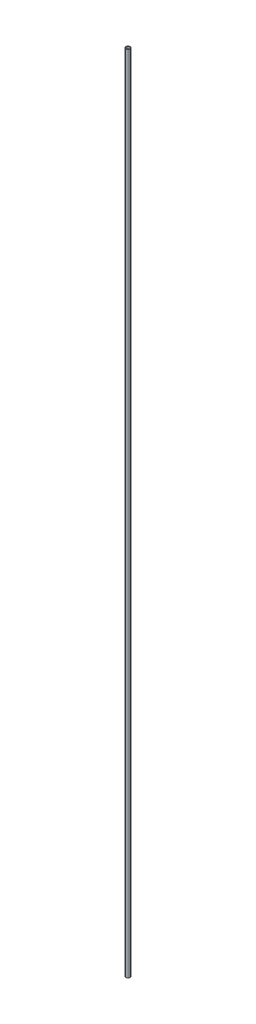
ISO-10303-21;
HEADER;
FILE_DESCRIPTION(('STEP AP214'),'2;1');
FILE_NAME('part.step','',(''),(''),'','','');
FILE_SCHEMA(('AUTOMOTIVE_DESIGN { 1 0 10303 214 1 1 1 1 }'));
ENDSEC;
DATA;
#1=APPLICATION_CONTEXT('core data for automotive mechanical design processes');
#2=APPLICATION_PROTOCOL_DEFINITION('international standard','automotive_design',2000,#1);
#3=PRODUCT_CONTEXT('',#1,'mechanical');
#4=PRODUCT('Part','Part','',(#3));
#5=PRODUCT_RELATED_PRODUCT_CATEGORY('part','',(#4));
#6=PRODUCT_DEFINITION_FORMATION('','',#4);
#7=PRODUCT_DEFINITION_CONTEXT('part definition',#1,'design');
#8=PRODUCT_DEFINITION('design','',#6,#7);
#9=PRODUCT_DEFINITION_SHAPE('','',#8);
#10=(LENGTH_UNIT() NAMED_UNIT(*) SI_UNIT(.MILLI.,.METRE.));
#11=(NAMED_UNIT(*) PLANE_ANGLE_UNIT() SI_UNIT($,.RADIAN.));
#12=(NAMED_UNIT(*) SI_UNIT($,.STERADIAN.) SOLID_ANGLE_UNIT());
#13=UNCERTAINTY_MEASURE_WITH_UNIT(LENGTH_MEASURE(1.E-05),#10,'distance_accuracy_value','');
#14=(GEOMETRIC_REPRESENTATION_CONTEXT(3) GLOBAL_UNCERTAINTY_ASSIGNED_CONTEXT((#13)) GLOBAL_UNIT_ASSIGNED_CONTEXT((#10,
#11,#12)) REPRESENTATION_CONTEXT('',''));
#15=CARTESIAN_POINT('',(0.,0.,0.));
#16=DIRECTION('',(0.,0.,1.));
#17=DIRECTION('',(1.,0.,0.));
#18=AXIS2_PLACEMENT_3D('',#15,#16,#17);
#19=CARTESIAN_POINT('',(0.,1397.,0.));
#20=DIRECTION('',(0.,1.,0.));
#21=DIRECTION('',(0.,0.,1.));
#22=AXIS2_PLACEMENT_3D('',#19,#20,#21);
#23=PLANE('',#22);
#24=CARTESIAN_POINT('',(0.,1397.,0.));
#25=DIRECTION('',(0.,1.,0.));
#26=DIRECTION('',(0.,0.,1.));
#27=AXIS2_PLACEMENT_3D('',#24,#25,#26);
#28=CIRCLE('',#27,3.6195);
#29=CARTESIAN_POINT('',(0.,1397.,3.6195));
#30=VERTEX_POINT('',#29);
#31=EDGE_CURVE('E10',#30,#30,#28,.T.);
#32=ORIENTED_EDGE('',*,*,#31,.T.);
#33=EDGE_LOOP('',(#32));
#34=FACE_BOUND('',#33,.T.);
#35=CARTESIAN_POINT('',(0.,1397.,0.));
#36=DIRECTION('',(0.,1.,0.));
#37=DIRECTION('',(0.,0.,1.));
#38=AXIS2_PLACEMENT_3D('',#35,#36,#37);
#39=CIRCLE('',#38,2.8575);
#40=CARTESIAN_POINT('',(0.,1397.,2.8575));
#41=VERTEX_POINT('',#40);
#42=EDGE_CURVE('E50',#41,#41,#39,.T.);
#43=ORIENTED_EDGE('',*,*,#42,.F.);
#44=EDGE_LOOP('',(#43));
#45=FACE_BOUND('',#44,.T.);
#46=ADVANCED_FACE('F37',(#34,#45),#23,.T.);
#47=CARTESIAN_POINT('',(0.,0.,0.));
#48=DIRECTION('',(0.,1.,0.));
#49=DIRECTION('',(0.,0.,1.));
#50=AXIS2_PLACEMENT_3D('',#47,#48,#49);
#51=PLANE('',#50);
#52=CARTESIAN_POINT('',(0.,0.,0.));
#53=DIRECTION('',(0.,1.,0.));
#54=DIRECTION('',(0.,0.,1.));
#55=AXIS2_PLACEMENT_3D('',#52,#53,#54);
#56=CIRCLE('',#55,3.6195);
#57=CARTESIAN_POINT('',(0.,0.,3.6195));
#58=VERTEX_POINT('',#57);
#59=EDGE_CURVE('E41',#58,#58,#56,.T.);
#60=ORIENTED_EDGE('',*,*,#59,.F.);
#61=EDGE_LOOP('',(#60));
#62=FACE_BOUND('',#61,.T.);
#63=CARTESIAN_POINT('',(0.,0.,0.));
#64=DIRECTION('',(0.,1.,0.));
#65=DIRECTION('',(0.,0.,1.));
#66=AXIS2_PLACEMENT_3D('',#63,#64,#65);
#67=CIRCLE('',#66,2.8575);
#68=CARTESIAN_POINT('',(0.,0.,2.8575));
#69=VERTEX_POINT('',#68);
#70=EDGE_CURVE('E52',#69,#69,#67,.T.);
#71=ORIENTED_EDGE('',*,*,#70,.T.);
#72=EDGE_LOOP('',(#71));
#73=FACE_BOUND('',#72,.T.);
#74=ADVANCED_FACE('F64',(#62,#73),#51,.F.);
#75=CARTESIAN_POINT('',(0.,1397.,0.));
#76=DIRECTION('',(0.,-1.,0.));
#77=DIRECTION('',(0.,0.,-1.));
#78=AXIS2_PLACEMENT_3D('',#75,#76,#77);
#79=CYLINDRICAL_SURFACE('',#78,3.6195);
#80=ORIENTED_EDGE('',*,*,#31,.F.);
#81=EDGE_LOOP('',(#80));
#82=FACE_BOUND('',#81,.T.);
#83=ORIENTED_EDGE('',*,*,#59,.T.);
#84=EDGE_LOOP('',(#83));
#85=FACE_BOUND('',#84,.T.);
#86=ADVANCED_FACE('F39',(#82,#85),#79,.T.);
#87=CARTESIAN_POINT('',(0.,1397.,0.));
#88=DIRECTION('',(0.,-1.,0.));
#89=DIRECTION('',(0.,0.,-1.));
#90=AXIS2_PLACEMENT_3D('',#87,#88,#89);
#91=CYLINDRICAL_SURFACE('',#90,2.8575);
#92=ORIENTED_EDGE('',*,*,#42,.T.);
#93=EDGE_LOOP('',(#92));
#94=FACE_BOUND('',#93,.T.);
#95=ORIENTED_EDGE('',*,*,#70,.F.);
#96=EDGE_LOOP('',(#95));
#97=FACE_BOUND('',#96,.T.);
#98=ADVANCED_FACE('F60',(#94,#97),#91,.F.);
#99=CLOSED_SHELL('',(#46,#74,#86,#98));
#100=MANIFOLD_SOLID_BREP('B2',#99);
#101=ADVANCED_BREP_SHAPE_REPRESENTATION('',(#18,#100),#14);
#102=SHAPE_DEFINITION_REPRESENTATION(#9,#101);
ENDSEC;
END-ISO-10303-21;
